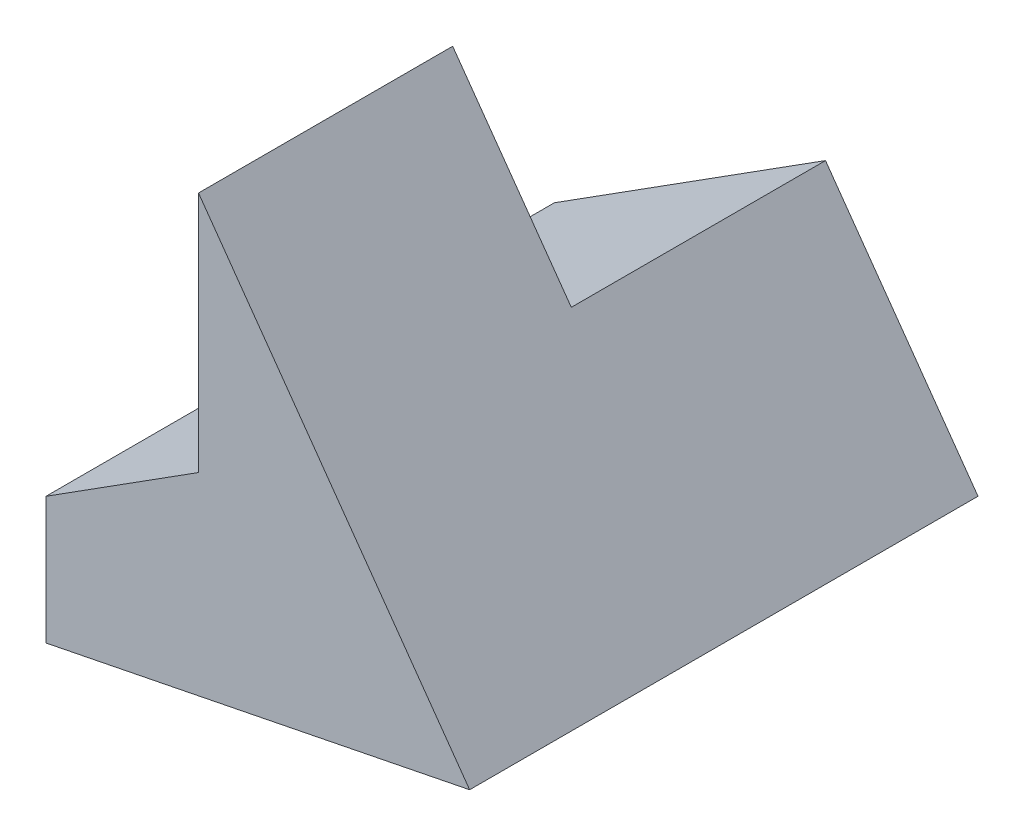
ISO-10303-21;
HEADER;
FILE_DESCRIPTION(('STEP AP214'),'2;1');
FILE_NAME('part.step','',(''),(''),'','','');
FILE_SCHEMA(('AUTOMOTIVE_DESIGN { 1 0 10303 214 1 1 1 1 }'));
ENDSEC;
DATA;
#1=APPLICATION_CONTEXT('core data for automotive mechanical design processes');
#2=APPLICATION_PROTOCOL_DEFINITION('international standard','automotive_design',2000,#1);
#3=PRODUCT_CONTEXT('',#1,'mechanical');
#4=PRODUCT('Part','Part','',(#3));
#5=PRODUCT_RELATED_PRODUCT_CATEGORY('part','',(#4));
#6=PRODUCT_DEFINITION_FORMATION('','',#4);
#7=PRODUCT_DEFINITION_CONTEXT('part definition',#1,'design');
#8=PRODUCT_DEFINITION('design','',#6,#7);
#9=PRODUCT_DEFINITION_SHAPE('','',#8);
#10=(LENGTH_UNIT() NAMED_UNIT(*) SI_UNIT(.MILLI.,.METRE.));
#11=(NAMED_UNIT(*) PLANE_ANGLE_UNIT() SI_UNIT($,.RADIAN.));
#12=(NAMED_UNIT(*) SI_UNIT($,.STERADIAN.) SOLID_ANGLE_UNIT());
#13=UNCERTAINTY_MEASURE_WITH_UNIT(LENGTH_MEASURE(1.E-05),#10,'distance_accuracy_value','');
#14=(GEOMETRIC_REPRESENTATION_CONTEXT(3) GLOBAL_UNCERTAINTY_ASSIGNED_CONTEXT((#13)) GLOBAL_UNIT_ASSIGNED_CONTEXT((#10,
#11,#12)) REPRESENTATION_CONTEXT('',''));
#15=CARTESIAN_POINT('',(0.,0.,0.));
#16=DIRECTION('',(0.,0.,1.));
#17=DIRECTION('',(1.,0.,0.));
#18=AXIS2_PLACEMENT_3D('',#15,#16,#17);
#19=CARTESIAN_POINT('',(1.8,5.5,3.));
#20=DIRECTION('',(1.,0.,0.));
#21=DIRECTION('',(0.,1.,0.));
#22=AXIS2_PLACEMENT_3D('',#19,#20,#21);
#23=PLANE('',#22);
#24=DIRECTION('',(0.,0.,-1.));
#25=VECTOR('',#24,1.);
#26=CARTESIAN_POINT('',(1.8,2.642578125,3.));
#27=LINE('',#26,#25);
#28=CARTESIAN_POINT('',(1.8,2.642578125,3.));
#29=VERTEX_POINT('',#28);
#30=CARTESIAN_POINT('',(1.8,2.642578125,0.));
#31=VERTEX_POINT('',#30);
#32=EDGE_CURVE('E92',#29,#31,#27,.T.);
#33=ORIENTED_EDGE('',*,*,#32,.F.);
#34=DIRECTION('',(0.,-1.,0.));
#35=VECTOR('',#34,1.);
#36=CARTESIAN_POINT('',(1.8,5.5,3.));
#37=LINE('',#36,#35);
#38=CARTESIAN_POINT('',(1.8,5.5,3.));
#39=VERTEX_POINT('',#38);
#40=EDGE_CURVE('E89',#39,#29,#37,.T.);
#41=ORIENTED_EDGE('',*,*,#40,.F.);
#42=DIRECTION('',(0.,0.,-1.));
#43=VECTOR('',#42,1.);
#44=CARTESIAN_POINT('',(1.8,5.5,3.));
#45=LINE('',#44,#43);
#46=CARTESIAN_POINT('',(1.8,5.5,0.));
#47=VERTEX_POINT('',#46);
#48=EDGE_CURVE('E102',#39,#47,#45,.T.);
#49=ORIENTED_EDGE('',*,*,#48,.T.);
#50=DIRECTION('',(0.,-1.,0.));
#51=VECTOR('',#50,1.);
#52=CARTESIAN_POINT('',(1.8,5.5,0.));
#53=LINE('',#52,#51);
#54=EDGE_CURVE('E105',#47,#31,#53,.T.);
#55=ORIENTED_EDGE('',*,*,#54,.T.);
#56=EDGE_LOOP('',(#33,#41,#49,#55));
#57=FACE_BOUND('',#56,.T.);
#58=ADVANCED_FACE('F33',(#57),#23,.F.);
#59=CARTESIAN_POINT('',(0.,1.5,3.));
#60=DIRECTION('',(1.,0.,0.));
#61=DIRECTION('',(0.,1.,0.));
#62=AXIS2_PLACEMENT_3D('',#59,#60,#61);
#63=PLANE('',#62);
#64=DIRECTION('',(0.,0.,-1.));
#65=VECTOR('',#64,1.);
#66=CARTESIAN_POINT('',(0.,1.5,3.));
#67=LINE('',#66,#65);
#68=CARTESIAN_POINT('',(0.,1.5,3.));
#69=VERTEX_POINT('',#68);
#70=CARTESIAN_POINT('',(0.,1.5,-3.));
#71=VERTEX_POINT('',#70);
#72=EDGE_CURVE('E95',#69,#71,#67,.T.);
#73=ORIENTED_EDGE('',*,*,#72,.T.);
#74=DIRECTION('',(0.,1.,0.));
#75=VECTOR('',#74,1.);
#76=CARTESIAN_POINT('',(0.,1.5,-3.));
#77=LINE('',#76,#75);
#78=CARTESIAN_POINT('',(0.,0.,-3.));
#79=VERTEX_POINT('',#78);
#80=EDGE_CURVE('E131',#79,#71,#77,.T.);
#81=ORIENTED_EDGE('',*,*,#80,.F.);
#82=DIRECTION('',(0.,0.,-1.));
#83=VECTOR('',#82,1.);
#84=CARTESIAN_POINT('',(0.,0.,3.));
#85=LINE('',#84,#83);
#86=CARTESIAN_POINT('',(0.,0.,3.));
#87=VERTEX_POINT('',#86);
#88=EDGE_CURVE('E11',#87,#79,#85,.T.);
#89=ORIENTED_EDGE('',*,*,#88,.F.);
#90=DIRECTION('',(0.,-1.,0.));
#91=VECTOR('',#90,1.);
#92=CARTESIAN_POINT('',(0.,1.5,3.));
#93=LINE('',#92,#91);
#94=EDGE_CURVE('E86',#69,#87,#93,.T.);
#95=ORIENTED_EDGE('',*,*,#94,.F.);
#96=EDGE_LOOP('',(#73,#81,#89,#95));
#97=FACE_BOUND('',#96,.T.);
#98=ADVANCED_FACE('F35',(#97),#63,.F.);
#99=CARTESIAN_POINT('',(0.,0.,3.));
#100=DIRECTION('',(-0.196116135138184,0.98058067569092,0.));
#101=DIRECTION('',(-0.98058067569092,-0.196116135138184,0.));
#102=AXIS2_PLACEMENT_3D('',#99,#100,#101);
#103=PLANE('',#102);
#104=ORIENTED_EDGE('',*,*,#88,.T.);
#105=DIRECTION('',(-0.98058067569092,-0.196116135138184,0.));
#106=VECTOR('',#105,1.);
#107=CARTESIAN_POINT('',(0.,0.,-3.));
#108=LINE('',#107,#106);
#109=CARTESIAN_POINT('',(5.,1.,-3.));
#110=VERTEX_POINT('',#109);
#111=EDGE_CURVE('E135',#110,#79,#108,.T.);
#112=ORIENTED_EDGE('',*,*,#111,.F.);
#113=DIRECTION('',(0.,0.,-1.));
#114=VECTOR('',#113,1.);
#115=CARTESIAN_POINT('',(5.,1.,3.));
#116=LINE('',#115,#114);
#117=CARTESIAN_POINT('',(5.,1.,3.));
#118=VERTEX_POINT('',#117);
#119=EDGE_CURVE('E44',#118,#110,#116,.T.);
#120=ORIENTED_EDGE('',*,*,#119,.F.);
#121=DIRECTION('',(0.98058067569092,0.196116135138184,0.));
#122=VECTOR('',#121,1.);
#123=CARTESIAN_POINT('',(0.,0.,3.));
#124=LINE('',#123,#122);
#125=EDGE_CURVE('E104',#87,#118,#124,.T.);
#126=ORIENTED_EDGE('',*,*,#125,.F.);
#127=EDGE_LOOP('',(#104,#112,#120,#126));
#128=FACE_BOUND('',#127,.T.);
#129=ADVANCED_FACE('F150',(#128),#103,.F.);
#130=CARTESIAN_POINT('',(5.,1.,3.));
#131=DIRECTION('',(-0.814955324568755,-0.579523786360004,0.));
#132=DIRECTION('',(0.579523786360004,-0.814955324568755,0.));
#133=AXIS2_PLACEMENT_3D('',#130,#131,#132);
#134=PLANE('',#133);
#135=ORIENTED_EDGE('',*,*,#119,.T.);
#136=DIRECTION('',(0.579523786360004,-0.814955324568755,0.));
#137=VECTOR('',#136,1.);
#138=CARTESIAN_POINT('',(5.,1.,-3.));
#139=LINE('',#138,#137);
#140=CARTESIAN_POINT('',(3.2,3.53125,-3.));
#141=VERTEX_POINT('',#140);
#142=EDGE_CURVE('E112',#141,#110,#139,.T.);
#143=ORIENTED_EDGE('',*,*,#142,.F.);
#144=DIRECTION('',(0.,0.,1.));
#145=VECTOR('',#144,1.);
#146=CARTESIAN_POINT('',(3.2,3.53125,-3.));
#147=LINE('',#146,#145);
#148=CARTESIAN_POINT('',(3.2,3.53125,0.));
#149=VERTEX_POINT('',#148);
#150=EDGE_CURVE('E121',#141,#149,#147,.T.);
#151=ORIENTED_EDGE('',*,*,#150,.T.);
#152=DIRECTION('',(-0.579523786360004,0.814955324568755,0.));
#153=VECTOR('',#152,1.);
#154=CARTESIAN_POINT('',(5.,1.,0.));
#155=LINE('',#154,#153);
#156=EDGE_CURVE('E109',#149,#47,#155,.T.);
#157=ORIENTED_EDGE('',*,*,#156,.T.);
#158=ORIENTED_EDGE('',*,*,#48,.F.);
#159=DIRECTION('',(-0.579523786360004,0.814955324568755,0.));
#160=VECTOR('',#159,1.);
#161=CARTESIAN_POINT('',(5.,1.,3.));
#162=LINE('',#161,#160);
#163=EDGE_CURVE('E52',#118,#39,#162,.T.);
#164=ORIENTED_EDGE('',*,*,#163,.F.);
#165=EDGE_LOOP('',(#135,#143,#151,#157,#158,#164));
#166=FACE_BOUND('',#165,.T.);
#167=ADVANCED_FACE('F148',(#166),#134,.F.);
#168=CARTESIAN_POINT('',(0.,0.,3.));
#169=DIRECTION('',(0.,0.,-1.));
#170=DIRECTION('',(-1.,0.,0.));
#171=AXIS2_PLACEMENT_3D('',#168,#169,#170);
#172=PLANE('',#171);
#173=DIRECTION('',(-0.84427202966114,-0.535914862577871,0.));
#174=VECTOR('',#173,1.);
#175=CARTESIAN_POINT('',(0.,1.5,3.));
#176=LINE('',#175,#174);
#177=EDGE_CURVE('E82',#29,#69,#176,.T.);
#178=ORIENTED_EDGE('',*,*,#177,.T.);
#179=ORIENTED_EDGE('',*,*,#94,.T.);
#180=ORIENTED_EDGE('',*,*,#125,.T.);
#181=ORIENTED_EDGE('',*,*,#163,.T.);
#182=ORIENTED_EDGE('',*,*,#40,.T.);
#183=EDGE_LOOP('',(#178,#179,#180,#181,#182));
#184=FACE_BOUND('',#183,.T.);
#185=ADVANCED_FACE('F84',(#184),#172,.F.);
#186=CARTESIAN_POINT('',(0.,0.,0.));
#187=DIRECTION('',(0.,0.,-1.));
#188=DIRECTION('',(-1.,0.,0.));
#189=AXIS2_PLACEMENT_3D('',#186,#187,#188);
#190=PLANE('',#189);
#191=DIRECTION('',(0.84427202966114,0.535914862577871,0.));
#192=VECTOR('',#191,1.);
#193=CARTESIAN_POINT('',(3.2,3.53125,0.));
#194=LINE('',#193,#192);
#195=EDGE_CURVE('E37',#31,#149,#194,.T.);
#196=ORIENTED_EDGE('',*,*,#195,.F.);
#197=ORIENTED_EDGE('',*,*,#54,.F.);
#198=ORIENTED_EDGE('',*,*,#156,.F.);
#199=EDGE_LOOP('',(#196,#197,#198));
#200=FACE_BOUND('',#199,.T.);
#201=ADVANCED_FACE('F145',(#200),#190,.T.);
#202=CARTESIAN_POINT('',(0.,0.,-3.));
#203=DIRECTION('',(0.,0.,-1.));
#204=DIRECTION('',(-1.,0.,0.));
#205=AXIS2_PLACEMENT_3D('',#202,#203,#204);
#206=PLANE('',#205);
#207=DIRECTION('',(0.84427202966114,0.535914862577871,0.));
#208=VECTOR('',#207,1.);
#209=CARTESIAN_POINT('',(3.2,3.53125,-3.));
#210=LINE('',#209,#208);
#211=EDGE_CURVE('E98',#71,#141,#210,.T.);
#212=ORIENTED_EDGE('',*,*,#211,.T.);
#213=ORIENTED_EDGE('',*,*,#142,.T.);
#214=ORIENTED_EDGE('',*,*,#111,.T.);
#215=ORIENTED_EDGE('',*,*,#80,.T.);
#216=EDGE_LOOP('',(#212,#213,#214,#215));
#217=FACE_BOUND('',#216,.T.);
#218=ADVANCED_FACE('F151',(#217),#206,.T.);
#219=CARTESIAN_POINT('',(3.2,3.53125,0.));
#220=DIRECTION('',(-0.535914862577872,0.84427202966114,0.));
#221=DIRECTION('',(-0.84427202966114,-0.535914862577872,0.));
#222=AXIS2_PLACEMENT_3D('',#219,#220,#221);
#223=PLANE('',#222);
#224=ORIENTED_EDGE('',*,*,#211,.F.);
#225=ORIENTED_EDGE('',*,*,#72,.F.);
#226=ORIENTED_EDGE('',*,*,#177,.F.);
#227=ORIENTED_EDGE('',*,*,#32,.T.);
#228=ORIENTED_EDGE('',*,*,#195,.T.);
#229=ORIENTED_EDGE('',*,*,#150,.F.);
#230=EDGE_LOOP('',(#224,#225,#226,#227,#228,#229));
#231=FACE_BOUND('',#230,.T.);
#232=ADVANCED_FACE('F96',(#231),#223,.T.);
#233=CLOSED_SHELL('',(#58,#98,#129,#167,#185,#201,#218,#232));
#234=MANIFOLD_SOLID_BREP('B2',#233);
#235=ADVANCED_BREP_SHAPE_REPRESENTATION('',(#18,#234),#14);
#236=SHAPE_DEFINITION_REPRESENTATION(#9,#235);
ENDSEC;
END-ISO-10303-21;
